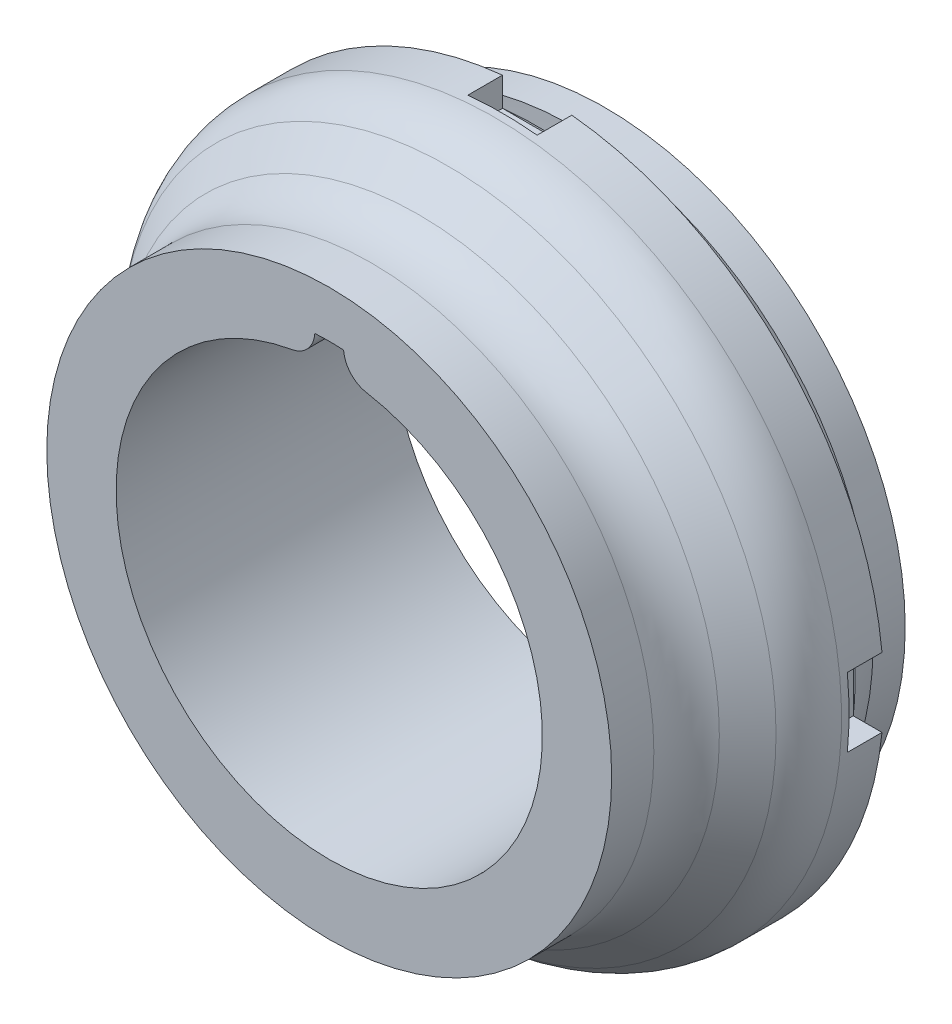
ISO-10303-21;
HEADER;
FILE_DESCRIPTION(('STEP AP214'),'2;1');
FILE_NAME('part.step','',(''),(''),'','','');
FILE_SCHEMA(('AUTOMOTIVE_DESIGN { 1 0 10303 214 1 1 1 1 }'));
ENDSEC;
DATA;
#1=APPLICATION_CONTEXT('core data for automotive mechanical design processes');
#2=APPLICATION_PROTOCOL_DEFINITION('international standard','automotive_design',2000,#1);
#3=PRODUCT_CONTEXT('',#1,'mechanical');
#4=PRODUCT('Part','Part','',(#3));
#5=PRODUCT_RELATED_PRODUCT_CATEGORY('part','',(#4));
#6=PRODUCT_DEFINITION_FORMATION('','',#4);
#7=PRODUCT_DEFINITION_CONTEXT('part definition',#1,'design');
#8=PRODUCT_DEFINITION('design','',#6,#7);
#9=PRODUCT_DEFINITION_SHAPE('','',#8);
#10=(LENGTH_UNIT() NAMED_UNIT(*) SI_UNIT(.MILLI.,.METRE.));
#11=(NAMED_UNIT(*) PLANE_ANGLE_UNIT() SI_UNIT($,.RADIAN.));
#12=(NAMED_UNIT(*) SI_UNIT($,.STERADIAN.) SOLID_ANGLE_UNIT());
#13=UNCERTAINTY_MEASURE_WITH_UNIT(LENGTH_MEASURE(1.E-05),#10,'distance_accuracy_value','');
#14=(GEOMETRIC_REPRESENTATION_CONTEXT(3) GLOBAL_UNCERTAINTY_ASSIGNED_CONTEXT((#13)) GLOBAL_UNIT_ASSIGNED_CONTEXT((#10,
#11,#12)) REPRESENTATION_CONTEXT('',''));
#15=CARTESIAN_POINT('',(0.,0.,0.));
#16=DIRECTION('',(0.,0.,1.));
#17=DIRECTION('',(1.,0.,0.));
#18=AXIS2_PLACEMENT_3D('',#15,#16,#17);
#19=CARTESIAN_POINT('',(0.,-5.,1.02));
#20=DIRECTION('',(0.,0.,-1.));
#21=DIRECTION('',(-1.,0.,0.));
#22=AXIS2_PLACEMENT_3D('',#19,#20,#21);
#23=PLANE('',#22);
#24=DIRECTION('',(-1.,0.,0.));
#25=VECTOR('',#24,1.);
#26=CARTESIAN_POINT('',(-5.43968920659189,-0.499999999999981,1.02));
#27=LINE('',#26,#25);
#28=CARTESIAN_POINT('',(-4.56031079340811,-0.499999999999984,1.02));
#29=VERTEX_POINT('',#28);
#30=CARTESIAN_POINT('',(-4.9749371855331,-0.499999999999983,1.02));
#31=VERTEX_POINT('',#30);
#32=EDGE_CURVE('E207',#29,#31,#27,.T.);
#33=ORIENTED_EDGE('',*,*,#32,.F.);
#34=CARTESIAN_POINT('',(0.,0.,1.02));
#35=DIRECTION('',(0.,0.,1.));
#36=DIRECTION('',(1.,0.,0.));
#37=AXIS2_PLACEMENT_3D('',#34,#35,#36);
#38=CIRCLE('',#37,4.587639320225);
#39=CARTESIAN_POINT('',(-0.499999999999999,-4.56031079340811,1.02));
#40=VERTEX_POINT('',#39);
#41=EDGE_CURVE('E189',#29,#40,#38,.T.);
#42=ORIENTED_EDGE('',*,*,#41,.T.);
#43=DIRECTION('',(0.,1.,0.));
#44=VECTOR('',#43,1.);
#45=CARTESIAN_POINT('',(-0.5,-5.43968920659189,1.02));
#46=LINE('',#45,#44);
#47=CARTESIAN_POINT('',(-0.5,-4.9749371855331,1.02));
#48=VERTEX_POINT('',#47);
#49=EDGE_CURVE('E311',#48,#40,#46,.T.);
#50=ORIENTED_EDGE('',*,*,#49,.F.);
#51=CARTESIAN_POINT('',(0.,0.,1.02));
#52=DIRECTION('',(0.,0.,1.));
#53=DIRECTION('',(1.,0.,0.));
#54=AXIS2_PLACEMENT_3D('',#51,#52,#53);
#55=CIRCLE('',#54,5.);
#56=EDGE_CURVE('E217',#31,#48,#55,.T.);
#57=ORIENTED_EDGE('',*,*,#56,.F.);
#58=EDGE_LOOP('',(#33,#42,#50,#57));
#59=FACE_BOUND('',#58,.T.);
#60=ADVANCED_FACE('F41',(#59),#23,.T.);
#61=DIRECTION('',(1.,0.,0.));
#62=VECTOR('',#61,1.);
#63=CARTESIAN_POINT('',(-5.43968920659189,0.500000000000019,1.02));
#64=LINE('',#63,#62);
#65=CARTESIAN_POINT('',(-4.9749371855331,0.500000000000017,1.02));
#66=VERTEX_POINT('',#65);
#67=CARTESIAN_POINT('',(-4.56031079340811,0.500000000000015,1.02));
#68=VERTEX_POINT('',#67);
#69=EDGE_CURVE('E259',#66,#68,#64,.T.);
#70=ORIENTED_EDGE('',*,*,#69,.F.);
#71=CARTESIAN_POINT('',(-0.5,4.9749371855331,1.02));
#72=VERTEX_POINT('',#71);
#73=EDGE_CURVE('E261',#72,#66,#55,.T.);
#74=ORIENTED_EDGE('',*,*,#73,.F.);
#75=DIRECTION('',(0.,1.,0.));
#76=VECTOR('',#75,1.);
#77=CARTESIAN_POINT('',(-0.5,5.43968920659189,1.02));
#78=LINE('',#77,#76);
#79=CARTESIAN_POINT('',(-0.5,4.56031079340811,1.02));
#80=VERTEX_POINT('',#79);
#81=EDGE_CURVE('E200',#80,#72,#78,.T.);
#82=ORIENTED_EDGE('',*,*,#81,.F.);
#83=EDGE_CURVE('E188',#80,#68,#38,.T.);
#84=ORIENTED_EDGE('',*,*,#83,.T.);
#85=EDGE_LOOP('',(#70,#74,#82,#84));
#86=FACE_BOUND('',#85,.T.);
#87=ADVANCED_FACE('F257',(#86),#23,.T.);
#88=DIRECTION('',(0.,-1.,0.));
#89=VECTOR('',#88,1.);
#90=CARTESIAN_POINT('',(0.5,5.43968920659189,1.02));
#91=LINE('',#90,#89);
#92=CARTESIAN_POINT('',(0.5,4.9749371855331,1.02));
#93=VERTEX_POINT('',#92);
#94=CARTESIAN_POINT('',(0.5,4.56031079340811,1.02));
#95=VERTEX_POINT('',#94);
#96=EDGE_CURVE('E747',#93,#95,#91,.T.);
#97=ORIENTED_EDGE('',*,*,#96,.F.);
#98=CARTESIAN_POINT('',(4.9749371855331,0.499999999999948,1.02));
#99=VERTEX_POINT('',#98);
#100=EDGE_CURVE('E352',#99,#93,#55,.T.);
#101=ORIENTED_EDGE('',*,*,#100,.F.);
#102=DIRECTION('',(1.,0.,0.));
#103=VECTOR('',#102,1.);
#104=CARTESIAN_POINT('',(5.43968920659189,0.499999999999943,1.02));
#105=LINE('',#104,#103);
#106=CARTESIAN_POINT('',(4.56031079340811,0.499999999999952,1.02));
#107=VERTEX_POINT('',#106);
#108=EDGE_CURVE('E297',#107,#99,#105,.T.);
#109=ORIENTED_EDGE('',*,*,#108,.F.);
#110=EDGE_CURVE('E239',#107,#95,#38,.T.);
#111=ORIENTED_EDGE('',*,*,#110,.T.);
#112=EDGE_LOOP('',(#97,#101,#109,#111));
#113=FACE_BOUND('',#112,.T.);
#114=ADVANCED_FACE('F427',(#113),#23,.T.);
#115=DIRECTION('',(-1.,0.,0.));
#116=VECTOR('',#115,1.);
#117=CARTESIAN_POINT('',(5.43968920659188,-0.500000000000057,1.02));
#118=LINE('',#117,#116);
#119=CARTESIAN_POINT('',(4.97493718553309,-0.500000000000052,1.02));
#120=VERTEX_POINT('',#119);
#121=CARTESIAN_POINT('',(4.5603107934081,-0.500000000000048,1.02));
#122=VERTEX_POINT('',#121);
#123=EDGE_CURVE('E276',#120,#122,#118,.T.);
#124=ORIENTED_EDGE('',*,*,#123,.F.);
#125=CARTESIAN_POINT('',(0.5,-4.9749371855331,1.02));
#126=VERTEX_POINT('',#125);
#127=EDGE_CURVE('E347',#126,#120,#55,.T.);
#128=ORIENTED_EDGE('',*,*,#127,.F.);
#129=DIRECTION('',(0.,-1.,0.));
#130=VECTOR('',#129,1.);
#131=CARTESIAN_POINT('',(0.5,-5.43968920659189,1.02));
#132=LINE('',#131,#130);
#133=CARTESIAN_POINT('',(0.5,-4.56031079340811,1.02));
#134=VERTEX_POINT('',#133);
#135=EDGE_CURVE('E218',#134,#126,#132,.T.);
#136=ORIENTED_EDGE('',*,*,#135,.F.);
#137=EDGE_CURVE('E229',#134,#122,#38,.T.);
#138=ORIENTED_EDGE('',*,*,#137,.T.);
#139=EDGE_LOOP('',(#124,#128,#136,#138));
#140=FACE_BOUND('',#139,.T.);
#141=ADVANCED_FACE('F422',(#140),#23,.T.);
#142=CARTESIAN_POINT('',(0.,0.,0.));
#143=DIRECTION('',(0.,0.,1.));
#144=DIRECTION('',(1.,0.,0.));
#145=AXIS2_PLACEMENT_3D('',#142,#143,#144);
#146=CYLINDRICAL_SURFACE('',#145,5.);
#147=CARTESIAN_POINT('',(0.,0.,1.62841808369457));
#148=DIRECTION('',(0.,0.,-1.));
#149=DIRECTION('',(-1.,0.,0.));
#150=AXIS2_PLACEMENT_3D('',#147,#148,#149);
#151=CIRCLE('',#150,5.);
#152=CARTESIAN_POINT('',(-5.,0.,1.62841808369457));
#153=VERTEX_POINT('',#152);
#154=EDGE_CURVE('E49',#153,#153,#151,.T.);
#155=ORIENTED_EDGE('',*,*,#154,.T.);
#156=EDGE_LOOP('',(#155));
#157=FACE_BOUND('',#156,.T.);
#158=DIRECTION('',(0.,0.,1.));
#159=VECTOR('',#158,1.);
#160=CARTESIAN_POINT('',(-4.9749371855331,-0.499999999999983,0.));
#161=LINE('',#160,#159);
#162=CARTESIAN_POINT('',(-4.9749371855331,-0.499999999999983,1.52));
#163=VERTEX_POINT('',#162);
#164=EDGE_CURVE('E210',#31,#163,#161,.T.);
#165=ORIENTED_EDGE('',*,*,#164,.F.);
#166=ORIENTED_EDGE('',*,*,#56,.T.);
#167=DIRECTION('',(0.,0.,1.));
#168=VECTOR('',#167,1.);
#169=CARTESIAN_POINT('',(-0.5,-4.9749371855331,0.));
#170=LINE('',#169,#168);
#171=CARTESIAN_POINT('',(-0.5,-4.9749371855331,1.52));
#172=VERTEX_POINT('',#171);
#173=EDGE_CURVE('E318',#172,#48,#170,.F.);
#174=ORIENTED_EDGE('',*,*,#173,.F.);
#175=CARTESIAN_POINT('',(0.,0.,1.52));
#176=DIRECTION('',(0.,0.,-1.));
#177=DIRECTION('',(-1.,0.,0.));
#178=AXIS2_PLACEMENT_3D('',#175,#176,#177);
#179=CIRCLE('',#178,5.);
#180=CARTESIAN_POINT('',(0.5,-4.9749371855331,1.52));
#181=VERTEX_POINT('',#180);
#182=EDGE_CURVE('E346',#172,#181,#179,.F.);
#183=ORIENTED_EDGE('',*,*,#182,.T.);
#184=DIRECTION('',(0.,0.,1.));
#185=VECTOR('',#184,1.);
#186=CARTESIAN_POINT('',(0.5,-4.9749371855331,0.));
#187=LINE('',#186,#185);
#188=EDGE_CURVE('E323',#126,#181,#187,.T.);
#189=ORIENTED_EDGE('',*,*,#188,.F.);
#190=ORIENTED_EDGE('',*,*,#127,.T.);
#191=DIRECTION('',(0.,0.,1.));
#192=VECTOR('',#191,1.);
#193=CARTESIAN_POINT('',(4.97493718553309,-0.500000000000052,0.));
#194=LINE('',#193,#192);
#195=CARTESIAN_POINT('',(4.97493718553309,-0.500000000000052,1.52));
#196=VERTEX_POINT('',#195);
#197=EDGE_CURVE('E274',#196,#120,#194,.F.);
#198=ORIENTED_EDGE('',*,*,#197,.F.);
#199=CARTESIAN_POINT('',(0.,0.,1.52));
#200=DIRECTION('',(0.,0.,-1.));
#201=DIRECTION('',(0.,-1.,0.));
#202=AXIS2_PLACEMENT_3D('',#199,#200,#201);
#203=CIRCLE('',#202,5.);
#204=CARTESIAN_POINT('',(4.9749371855331,0.499999999999948,1.52));
#205=VERTEX_POINT('',#204);
#206=EDGE_CURVE('E288',#196,#205,#203,.F.);
#207=ORIENTED_EDGE('',*,*,#206,.T.);
#208=DIRECTION('',(0.,0.,1.));
#209=VECTOR('',#208,1.);
#210=CARTESIAN_POINT('',(4.9749371855331,0.499999999999948,0.));
#211=LINE('',#210,#209);
#212=EDGE_CURVE('E294',#99,#205,#211,.T.);
#213=ORIENTED_EDGE('',*,*,#212,.F.);
#214=ORIENTED_EDGE('',*,*,#100,.T.);
#215=DIRECTION('',(0.,0.,1.));
#216=VECTOR('',#215,1.);
#217=CARTESIAN_POINT('',(0.5,4.9749371855331,0.));
#218=LINE('',#217,#216);
#219=CARTESIAN_POINT('',(0.5,4.9749371855331,1.52));
#220=VERTEX_POINT('',#219);
#221=EDGE_CURVE('E769',#220,#93,#218,.F.);
#222=ORIENTED_EDGE('',*,*,#221,.F.);
#223=CARTESIAN_POINT('',(0.,0.,1.52));
#224=DIRECTION('',(0.,0.,-1.));
#225=DIRECTION('',(1.,0.,0.));
#226=AXIS2_PLACEMENT_3D('',#223,#224,#225);
#227=CIRCLE('',#226,5.);
#228=CARTESIAN_POINT('',(-0.5,4.9749371855331,1.52));
#229=VERTEX_POINT('',#228);
#230=EDGE_CURVE('E753',#220,#229,#227,.F.);
#231=ORIENTED_EDGE('',*,*,#230,.T.);
#232=DIRECTION('',(0.,0.,1.));
#233=VECTOR('',#232,1.);
#234=CARTESIAN_POINT('',(-0.5,4.9749371855331,0.));
#235=LINE('',#234,#233);
#236=EDGE_CURVE('E266',#72,#229,#235,.T.);
#237=ORIENTED_EDGE('',*,*,#236,.F.);
#238=ORIENTED_EDGE('',*,*,#73,.T.);
#239=DIRECTION('',(0.,0.,1.));
#240=VECTOR('',#239,1.);
#241=CARTESIAN_POINT('',(-4.9749371855331,0.500000000000017,0.));
#242=LINE('',#241,#240);
#243=CARTESIAN_POINT('',(-4.9749371855331,0.500000000000017,1.52));
#244=VERTEX_POINT('',#243);
#245=EDGE_CURVE('E199',#244,#66,#242,.F.);
#246=ORIENTED_EDGE('',*,*,#245,.F.);
#247=CARTESIAN_POINT('',(0.,0.,1.52));
#248=DIRECTION('',(0.,0.,-1.));
#249=DIRECTION('',(0.,1.,0.));
#250=AXIS2_PLACEMENT_3D('',#247,#248,#249);
#251=CIRCLE('',#250,5.);
#252=EDGE_CURVE('E211',#244,#163,#251,.F.);
#253=ORIENTED_EDGE('',*,*,#252,.T.);
#254=EDGE_LOOP('',(#165,#166,#174,#183,#189,#190,#198,#207,#213,#214,#222,#231,#237,#238,#246,#253));
#255=FACE_BOUND('',#254,.T.);
#256=ADVANCED_FACE('F372',(#157,#255),#146,.T.);
#257=CARTESIAN_POINT('',(0.,0.,3.02));
#258=DIRECTION('',(0.,0.,-1.));
#259=DIRECTION('',(-1.,0.,0.));
#260=AXIS2_PLACEMENT_3D('',#257,#258,#259);
#261=CONICAL_SURFACE('',#260,4.075,0.746456820300408);
#262=CARTESIAN_POINT('',(0.,0.,2.30746006531199));
#263=DIRECTION('',(0.,0.,1.));
#264=DIRECTION('',(1.,0.,0.));
#265=AXIS2_PLACEMENT_3D('',#262,#263,#264);
#266=CIRCLE('',#265,4.73409943958641);
#267=CARTESIAN_POINT('',(4.73409943958641,0.,2.30746006531199));
#268=VERTEX_POINT('',#267);
#269=EDGE_CURVE('E367',#268,#268,#266,.T.);
#270=ORIENTED_EDGE('',*,*,#269,.T.);
#271=EDGE_LOOP('',(#270));
#272=FACE_BOUND('',#271,.T.);
#273=CARTESIAN_POINT('',(0.,0.,2.73253993468801));
#274=DIRECTION('',(0.,0.,-1.));
#275=DIRECTION('',(-1.,0.,0.));
#276=AXIS2_PLACEMENT_3D('',#273,#274,#275);
#277=CIRCLE('',#276,4.34090056041359);
#278=CARTESIAN_POINT('',(-4.34090056041359,0.,2.73253993468801));
#279=VERTEX_POINT('',#278);
#280=EDGE_CURVE('E364',#279,#279,#277,.T.);
#281=ORIENTED_EDGE('',*,*,#280,.T.);
#282=EDGE_LOOP('',(#281));
#283=FACE_BOUND('',#282,.T.);
#284=ADVANCED_FACE('F381',(#272,#283),#261,.T.);
#285=CARTESIAN_POINT('',(0.,0.,0.));
#286=DIRECTION('',(0.,0.,1.));
#287=DIRECTION('',(1.,0.,0.));
#288=AXIS2_PLACEMENT_3D('',#285,#286,#287);
#289=CYLINDRICAL_SURFACE('',#288,4.075);
#290=CARTESIAN_POINT('',(0.,0.,3.41158191630544));
#291=DIRECTION('',(0.,0.,1.));
#292=DIRECTION('',(1.,0.,0.));
#293=AXIS2_PLACEMENT_3D('',#290,#291,#292);
#294=CIRCLE('',#293,4.075);
#295=CARTESIAN_POINT('',(4.075,0.,3.41158191630544));
#296=VERTEX_POINT('',#295);
#297=EDGE_CURVE('E11',#296,#296,#294,.T.);
#298=ORIENTED_EDGE('',*,*,#297,.T.);
#299=EDGE_LOOP('',(#298));
#300=FACE_BOUND('',#299,.T.);
#301=CARTESIAN_POINT('',(0.,0.,4.02));
#302=DIRECTION('',(0.,0.,1.));
#303=DIRECTION('',(1.,0.,0.));
#304=AXIS2_PLACEMENT_3D('',#301,#302,#303);
#305=CIRCLE('',#304,4.075);
#306=CARTESIAN_POINT('',(4.075,0.,4.02));
#307=VERTEX_POINT('',#306);
#308=EDGE_CURVE('E398',#307,#307,#305,.T.);
#309=ORIENTED_EDGE('',*,*,#308,.F.);
#310=EDGE_LOOP('',(#309));
#311=FACE_BOUND('',#310,.T.);
#312=ADVANCED_FACE('F384',(#300,#311),#289,.T.);
#313=CARTESIAN_POINT('',(0.,-4.075,4.02));
#314=DIRECTION('',(0.,0.,1.));
#315=DIRECTION('',(1.,0.,0.));
#316=AXIS2_PLACEMENT_3D('',#313,#314,#315);
#317=PLANE('',#316);
#318=CARTESIAN_POINT('',(0.,0.,4.02));
#319=DIRECTION('',(0.,0.,1.));
#320=DIRECTION('',(1.,0.,0.));
#321=AXIS2_PLACEMENT_3D('',#318,#319,#320);
#322=CIRCLE('',#321,3.075);
#323=CARTESIAN_POINT('',(-0.53676182485942,3.02778991070609,4.02));
#324=VERTEX_POINT('',#323);
#325=CARTESIAN_POINT('',(0.536761824859422,3.02778991070609,4.02));
#326=VERTEX_POINT('',#325);
#327=EDGE_CURVE('E400',#324,#326,#322,.T.);
#328=ORIENTED_EDGE('',*,*,#327,.F.);
#329=CARTESIAN_POINT('',(-0.606584501263897,3.42164876087924,4.02));
#330=DIRECTION('',(0.,0.,1.));
#331=DIRECTION('',(1.,0.,0.));
#332=AXIS2_PLACEMENT_3D('',#329,#330,#331);
#333=CIRCLE('',#332,0.4);
#334=CARTESIAN_POINT('',(-0.207565034420009,3.39365831465879,4.02));
#335=VERTEX_POINT('',#334);
#336=EDGE_CURVE('E332',#324,#335,#333,.T.);
#337=ORIENTED_EDGE('',*,*,#336,.T.);
#338=CARTESIAN_POINT('',(0.,0.,4.02));
#339=DIRECTION('',(0.,0.,-1.));
#340=DIRECTION('',(-1.,0.,0.));
#341=AXIS2_PLACEMENT_3D('',#338,#339,#340);
#342=CIRCLE('',#341,3.40000000002449);
#343=CARTESIAN_POINT('',(0.207565034420009,3.39365831465879,4.02));
#344=VERTEX_POINT('',#343);
#345=EDGE_CURVE('E224',#335,#344,#342,.T.);
#346=ORIENTED_EDGE('',*,*,#345,.T.);
#347=CARTESIAN_POINT('',(0.6065845012639,3.42164876087924,4.02));
#348=DIRECTION('',(0.,0.,1.));
#349=DIRECTION('',(1.,0.,0.));
#350=AXIS2_PLACEMENT_3D('',#347,#348,#349);
#351=CIRCLE('',#350,0.4);
#352=EDGE_CURVE('E56',#344,#326,#351,.T.);
#353=ORIENTED_EDGE('',*,*,#352,.T.);
#354=EDGE_LOOP('',(#328,#337,#346,#353));
#355=FACE_BOUND('',#354,.T.);
#356=ORIENTED_EDGE('',*,*,#308,.T.);
#357=EDGE_LOOP('',(#356));
#358=FACE_BOUND('',#357,.T.);
#359=ADVANCED_FACE('F394',(#355,#358),#317,.T.);
#360=CARTESIAN_POINT('',(0.,0.,0.));
#361=DIRECTION('',(0.,0.,1.));
#362=DIRECTION('',(1.,0.,0.));
#363=AXIS2_PLACEMENT_3D('',#360,#361,#362);
#364=CYLINDRICAL_SURFACE('',#363,3.075);
#365=CARTESIAN_POINT('',(0.,0.,0.0399999999999998));
#366=DIRECTION('',(0.,0.,1.));
#367=DIRECTION('',(1.,0.,0.));
#368=AXIS2_PLACEMENT_3D('',#365,#366,#367);
#369=CIRCLE('',#368,3.075);
#370=CARTESIAN_POINT('',(-0.53676182485942,3.02778991070609,0.0399999999999998));
#371=VERTEX_POINT('',#370);
#372=CARTESIAN_POINT('',(0.536761824859422,3.02778991070609,0.0399999999999998));
#373=VERTEX_POINT('',#372);
#374=EDGE_CURVE('E401',#371,#373,#369,.T.);
#375=ORIENTED_EDGE('',*,*,#374,.F.);
#376=DIRECTION('',(0.,0.,1.));
#377=VECTOR('',#376,1.);
#378=CARTESIAN_POINT('',(-0.53676182485942,3.02778991070609,0.));
#379=LINE('',#378,#377);
#380=EDGE_CURVE('E63',#371,#324,#379,.T.);
#381=ORIENTED_EDGE('',*,*,#380,.T.);
#382=ORIENTED_EDGE('',*,*,#327,.T.);
#383=DIRECTION('',(0.,0.,1.));
#384=VECTOR('',#383,1.);
#385=CARTESIAN_POINT('',(0.536761824859422,3.02778991070609,0.));
#386=LINE('',#385,#384);
#387=EDGE_CURVE('E358',#326,#373,#386,.F.);
#388=ORIENTED_EDGE('',*,*,#387,.T.);
#389=EDGE_LOOP('',(#375,#381,#382,#388));
#390=FACE_BOUND('',#389,.T.);
#391=ADVANCED_FACE('F411',(#390),#364,.F.);
#392=CARTESIAN_POINT('',(0.,-4.33,0.0399999999999998));
#393=DIRECTION('',(0.,0.,-1.));
#394=DIRECTION('',(-1.,0.,0.));
#395=AXIS2_PLACEMENT_3D('',#392,#393,#394);
#396=PLANE('',#395);
#397=CARTESIAN_POINT('',(0.,0.,0.0399999999999998));
#398=DIRECTION('',(0.,0.,-1.));
#399=DIRECTION('',(-1.,0.,0.));
#400=AXIS2_PLACEMENT_3D('',#397,#398,#399);
#401=CIRCLE('',#400,3.40000000002449);
#402=CARTESIAN_POINT('',(-0.207565034420009,3.39365831465879,0.0400000000000001));
#403=VERTEX_POINT('',#402);
#404=CARTESIAN_POINT('',(0.207565034420009,3.3936583146588,0.0399999999999998));
#405=VERTEX_POINT('',#404);
#406=EDGE_CURVE('E339',#403,#405,#401,.T.);
#407=ORIENTED_EDGE('',*,*,#406,.F.);
#408=CARTESIAN_POINT('',(-0.606584501263897,3.42164876087924,0.0399999999999998));
#409=DIRECTION('',(0.,0.,-1.));
#410=DIRECTION('',(-1.,0.,0.));
#411=AXIS2_PLACEMENT_3D('',#408,#409,#410);
#412=CIRCLE('',#411,0.4);
#413=EDGE_CURVE('E333',#403,#371,#412,.T.);
#414=ORIENTED_EDGE('',*,*,#413,.T.);
#415=ORIENTED_EDGE('',*,*,#374,.T.);
#416=CARTESIAN_POINT('',(0.6065845012639,3.42164876087924,0.0399999999999998));
#417=DIRECTION('',(0.,0.,-1.));
#418=DIRECTION('',(-1.,0.,0.));
#419=AXIS2_PLACEMENT_3D('',#416,#417,#418);
#420=CIRCLE('',#419,0.4);
#421=EDGE_CURVE('E345',#373,#405,#420,.T.);
#422=ORIENTED_EDGE('',*,*,#421,.T.);
#423=EDGE_LOOP('',(#407,#414,#415,#422));
#424=FACE_BOUND('',#423,.T.);
#425=CARTESIAN_POINT('',(0.,0.,0.0399999999999998));
#426=DIRECTION('',(0.,0.,1.));
#427=DIRECTION('',(1.,0.,0.));
#428=AXIS2_PLACEMENT_3D('',#425,#426,#427);
#429=CIRCLE('',#428,4.33);
#430=CARTESIAN_POINT('',(4.33,0.,0.0399999999999998));
#431=VERTEX_POINT('',#430);
#432=EDGE_CURVE('E233',#431,#431,#429,.T.);
#433=ORIENTED_EDGE('',*,*,#432,.F.);
#434=EDGE_LOOP('',(#433));
#435=FACE_BOUND('',#434,.T.);
#436=ADVANCED_FACE('F342',(#424,#435),#396,.T.);
#437=CARTESIAN_POINT('',(0.,0.,0.));
#438=DIRECTION('',(0.,0.,1.));
#439=DIRECTION('',(1.,0.,0.));
#440=AXIS2_PLACEMENT_3D('',#437,#438,#439);
#441=CYLINDRICAL_SURFACE('',#440,4.33);
#442=ORIENTED_EDGE('',*,*,#432,.T.);
#443=EDGE_LOOP('',(#442));
#444=FACE_BOUND('',#443,.T.);
#445=CARTESIAN_POINT('',(0.,0.,0.504721359549997));
#446=DIRECTION('',(0.,0.,1.));
#447=DIRECTION('',(1.,0.,0.));
#448=AXIS2_PLACEMENT_3D('',#445,#446,#447);
#449=CIRCLE('',#448,4.33);
#450=CARTESIAN_POINT('',(4.33,0.,0.504721359549997));
#451=VERTEX_POINT('',#450);
#452=EDGE_CURVE('E228',#451,#451,#449,.T.);
#453=ORIENTED_EDGE('',*,*,#452,.F.);
#454=EDGE_LOOP('',(#453));
#455=FACE_BOUND('',#454,.T.);
#456=ADVANCED_FACE('F408',(#444,#455),#441,.T.);
#457=CARTESIAN_POINT('',(0.,0.,1.02));
#458=DIRECTION('',(0.,0.,1.));
#459=DIRECTION('',(1.,0.,0.));
#460=AXIS2_PLACEMENT_3D('',#457,#458,#459);
#461=CONICAL_SURFACE('',#460,4.587639320225,0.463647609000806);
#462=ORIENTED_EDGE('',*,*,#452,.T.);
#463=EDGE_LOOP('',(#462));
#464=FACE_BOUND('',#463,.T.);
#465=EDGE_CURVE('E223',#40,#134,#38,.T.);
#466=ORIENTED_EDGE('',*,*,#465,.F.);
#467=ORIENTED_EDGE('',*,*,#41,.F.);
#468=EDGE_CURVE('E180',#68,#29,#38,.T.);
#469=ORIENTED_EDGE('',*,*,#468,.F.);
#470=ORIENTED_EDGE('',*,*,#83,.F.);
#471=EDGE_CURVE('E245',#95,#80,#38,.T.);
#472=ORIENTED_EDGE('',*,*,#471,.F.);
#473=ORIENTED_EDGE('',*,*,#110,.F.);
#474=EDGE_CURVE('E235',#122,#107,#38,.T.);
#475=ORIENTED_EDGE('',*,*,#474,.F.);
#476=ORIENTED_EDGE('',*,*,#137,.F.);
#477=EDGE_LOOP('',(#466,#467,#469,#470,#472,#473,#475,#476));
#478=FACE_BOUND('',#477,.T.);
#479=ADVANCED_FACE('F221',(#464,#478),#461,.T.);
#480=CARTESIAN_POINT('',(0.,0.,0.));
#481=DIRECTION('',(0.,0.,-1.));
#482=DIRECTION('',(-1.,0.,0.));
#483=AXIS2_PLACEMENT_3D('',#480,#481,#482);
#484=CYLINDRICAL_SURFACE('',#483,3.40000000002449);
#485=ORIENTED_EDGE('',*,*,#406,.T.);
#486=DIRECTION('',(0.,0.,1.));
#487=VECTOR('',#486,1.);
#488=CARTESIAN_POINT('',(0.207565034420009,3.39365831465879,4.02));
#489=LINE('',#488,#487);
#490=EDGE_CURVE('E325',#405,#344,#489,.T.);
#491=ORIENTED_EDGE('',*,*,#490,.T.);
#492=ORIENTED_EDGE('',*,*,#345,.F.);
#493=DIRECTION('',(0.,0.,1.));
#494=VECTOR('',#493,1.);
#495=CARTESIAN_POINT('',(-0.207565034420009,3.39365831465879,4.02));
#496=LINE('',#495,#494);
#497=EDGE_CURVE('E225',#403,#335,#496,.T.);
#498=ORIENTED_EDGE('',*,*,#497,.F.);
#499=EDGE_LOOP('',(#485,#491,#492,#498));
#500=FACE_BOUND('',#499,.T.);
#501=ADVANCED_FACE('F338',(#500),#484,.F.);
#502=CARTESIAN_POINT('',(0.5,-5.43968920659189,1.52));
#503=DIRECTION('',(1.,0.,0.));
#504=DIRECTION('',(0.,0.,-1.));
#505=AXIS2_PLACEMENT_3D('',#502,#503,#504);
#506=PLANE('',#505);
#507=ORIENTED_EDGE('',*,*,#188,.T.);
#508=DIRECTION('',(0.,-1.,0.));
#509=VECTOR('',#508,1.);
#510=CARTESIAN_POINT('',(0.5,-5.43968920659189,1.52));
#511=LINE('',#510,#509);
#512=CARTESIAN_POINT('',(0.5,-4.56031079340811,1.52));
#513=VERTEX_POINT('',#512);
#514=EDGE_CURVE('E300',#513,#181,#511,.T.);
#515=ORIENTED_EDGE('',*,*,#514,.F.);
#516=DIRECTION('',(0.,0.,-1.));
#517=VECTOR('',#516,1.);
#518=CARTESIAN_POINT('',(0.5,-4.56031079340811,1.52));
#519=LINE('',#518,#517);
#520=EDGE_CURVE('E316',#513,#134,#519,.T.);
#521=ORIENTED_EDGE('',*,*,#520,.T.);
#522=ORIENTED_EDGE('',*,*,#135,.T.);
#523=EDGE_LOOP('',(#507,#515,#521,#522));
#524=FACE_BOUND('',#523,.T.);
#525=ADVANCED_FACE('F443',(#524),#506,.F.);
#526=CARTESIAN_POINT('',(-0.5,-4.56031079340811,1.52));
#527=DIRECTION('',(0.,1.,0.));
#528=DIRECTION('',(0.,0.,1.));
#529=AXIS2_PLACEMENT_3D('',#526,#527,#528);
#530=PLANE('',#529);
#531=DIRECTION('',(1.,0.,0.));
#532=VECTOR('',#531,1.);
#533=CARTESIAN_POINT('',(-0.5,-4.56031079340811,1.02));
#534=LINE('',#533,#532);
#535=EDGE_CURVE('E304',#40,#134,#534,.T.);
#536=ORIENTED_EDGE('',*,*,#535,.T.);
#537=ORIENTED_EDGE('',*,*,#520,.F.);
#538=DIRECTION('',(1.,0.,0.));
#539=VECTOR('',#538,1.);
#540=CARTESIAN_POINT('',(-0.5,-4.56031079340811,1.52));
#541=LINE('',#540,#539);
#542=CARTESIAN_POINT('',(-0.5,-4.56031079340811,1.52));
#543=VERTEX_POINT('',#542);
#544=EDGE_CURVE('E306',#543,#513,#541,.T.);
#545=ORIENTED_EDGE('',*,*,#544,.F.);
#546=DIRECTION('',(0.,0.,-1.));
#547=VECTOR('',#546,1.);
#548=CARTESIAN_POINT('',(-0.5,-4.56031079340811,1.52));
#549=LINE('',#548,#547);
#550=EDGE_CURVE('E309',#543,#40,#549,.T.);
#551=ORIENTED_EDGE('',*,*,#550,.T.);
#552=EDGE_LOOP('',(#536,#537,#545,#551));
#553=FACE_BOUND('',#552,.T.);
#554=ADVANCED_FACE('F450',(#553),#530,.F.);
#555=CARTESIAN_POINT('',(-0.5,-5.43968920659189,1.52));
#556=DIRECTION('',(-1.,0.,0.));
#557=DIRECTION('',(0.,0.,1.));
#558=AXIS2_PLACEMENT_3D('',#555,#556,#557);
#559=PLANE('',#558);
#560=ORIENTED_EDGE('',*,*,#173,.T.);
#561=ORIENTED_EDGE('',*,*,#49,.T.);
#562=ORIENTED_EDGE('',*,*,#550,.F.);
#563=DIRECTION('',(0.,1.,0.));
#564=VECTOR('',#563,1.);
#565=CARTESIAN_POINT('',(-0.5,-5.43968920659189,1.52));
#566=LINE('',#565,#564);
#567=EDGE_CURVE('E303',#172,#543,#566,.T.);
#568=ORIENTED_EDGE('',*,*,#567,.F.);
#569=EDGE_LOOP('',(#560,#561,#562,#568));
#570=FACE_BOUND('',#569,.T.);
#571=ADVANCED_FACE('F463',(#570),#559,.F.);
#572=CARTESIAN_POINT('',(0.,0.,1.52));
#573=DIRECTION('',(0.,0.,-1.));
#574=DIRECTION('',(-1.,0.,0.));
#575=AXIS2_PLACEMENT_3D('',#572,#573,#574);
#576=PLANE('',#575);
#577=ORIENTED_EDGE('',*,*,#567,.T.);
#578=ORIENTED_EDGE('',*,*,#544,.T.);
#579=ORIENTED_EDGE('',*,*,#514,.T.);
#580=ORIENTED_EDGE('',*,*,#182,.F.);
#581=EDGE_LOOP('',(#577,#578,#579,#580));
#582=FACE_BOUND('',#581,.T.);
#583=ADVANCED_FACE('F445',(#582),#576,.T.);
#584=CARTESIAN_POINT('',(0.,0.,1.02));
#585=DIRECTION('',(0.,0.,-1.));
#586=DIRECTION('',(-1.,0.,0.));
#587=AXIS2_PLACEMENT_3D('',#584,#585,#586);
#588=PLANE('',#587);
#589=ORIENTED_EDGE('',*,*,#465,.T.);
#590=ORIENTED_EDGE('',*,*,#535,.F.);
#591=EDGE_LOOP('',(#589,#590));
#592=FACE_BOUND('',#591,.T.);
#593=ADVANCED_FACE('F451',(#592),#588,.F.);
#594=CARTESIAN_POINT('',(5.43968920659189,0.499999999999943,1.52));
#595=DIRECTION('',(0.,1.,0.));
#596=DIRECTION('',(0.,0.,-1.));
#597=AXIS2_PLACEMENT_3D('',#594,#595,#596);
#598=PLANE('',#597);
#599=ORIENTED_EDGE('',*,*,#212,.T.);
#600=DIRECTION('',(1.,0.,0.));
#601=VECTOR('',#600,1.);
#602=CARTESIAN_POINT('',(5.43968920659189,0.499999999999943,1.52));
#603=LINE('',#602,#601);
#604=CARTESIAN_POINT('',(4.56031079340811,0.499999999999952,1.52));
#605=VERTEX_POINT('',#604);
#606=EDGE_CURVE('E286',#605,#205,#603,.T.);
#607=ORIENTED_EDGE('',*,*,#606,.F.);
#608=DIRECTION('',(0.,0.,-1.));
#609=VECTOR('',#608,1.);
#610=CARTESIAN_POINT('',(4.56031079340811,0.499999999999952,1.52));
#611=LINE('',#610,#609);
#612=EDGE_CURVE('E291',#605,#107,#611,.T.);
#613=ORIENTED_EDGE('',*,*,#612,.T.);
#614=ORIENTED_EDGE('',*,*,#108,.T.);
#615=EDGE_LOOP('',(#599,#607,#613,#614));
#616=FACE_BOUND('',#615,.T.);
#617=ADVANCED_FACE('F453',(#616),#598,.F.);
#618=CARTESIAN_POINT('',(4.5603107934081,-0.500000000000048,1.52));
#619=DIRECTION('',(-1.,0.,0.));
#620=DIRECTION('',(0.,0.,1.));
#621=AXIS2_PLACEMENT_3D('',#618,#619,#620);
#622=PLANE('',#621);
#623=DIRECTION('',(0.,1.,0.));
#624=VECTOR('',#623,1.);
#625=CARTESIAN_POINT('',(4.5603107934081,-0.500000000000048,1.02));
#626=LINE('',#625,#624);
#627=EDGE_CURVE('E272',#122,#107,#626,.T.);
#628=ORIENTED_EDGE('',*,*,#627,.T.);
#629=ORIENTED_EDGE('',*,*,#612,.F.);
#630=DIRECTION('',(0.,1.,0.));
#631=VECTOR('',#630,1.);
#632=CARTESIAN_POINT('',(4.5603107934081,-0.500000000000048,1.52));
#633=LINE('',#632,#631);
#634=CARTESIAN_POINT('',(4.5603107934081,-0.500000000000048,1.52));
#635=VERTEX_POINT('',#634);
#636=EDGE_CURVE('E284',#635,#605,#633,.T.);
#637=ORIENTED_EDGE('',*,*,#636,.F.);
#638=DIRECTION('',(0.,0.,-1.));
#639=VECTOR('',#638,1.);
#640=CARTESIAN_POINT('',(4.5603107934081,-0.500000000000048,1.52));
#641=LINE('',#640,#639);
#642=EDGE_CURVE('E279',#635,#122,#641,.T.);
#643=ORIENTED_EDGE('',*,*,#642,.T.);
#644=EDGE_LOOP('',(#628,#629,#637,#643));
#645=FACE_BOUND('',#644,.T.);
#646=ADVANCED_FACE('F460',(#645),#622,.F.);
#647=CARTESIAN_POINT('',(0.,0.,1.52));
#648=DIRECTION('',(0.,0.,-1.));
#649=DIRECTION('',(0.,-1.,0.));
#650=AXIS2_PLACEMENT_3D('',#647,#648,#649);
#651=PLANE('',#650);
#652=DIRECTION('',(-1.,0.,0.));
#653=VECTOR('',#652,1.);
#654=CARTESIAN_POINT('',(5.43968920659188,-0.500000000000057,1.52));
#655=LINE('',#654,#653);
#656=EDGE_CURVE('E281',#196,#635,#655,.T.);
#657=ORIENTED_EDGE('',*,*,#656,.T.);
#658=ORIENTED_EDGE('',*,*,#636,.T.);
#659=ORIENTED_EDGE('',*,*,#606,.T.);
#660=ORIENTED_EDGE('',*,*,#206,.F.);
#661=EDGE_LOOP('',(#657,#658,#659,#660));
#662=FACE_BOUND('',#661,.T.);
#663=ADVANCED_FACE('F695',(#662),#651,.T.);
#664=CARTESIAN_POINT('',(5.43968920659188,-0.500000000000057,1.52));
#665=DIRECTION('',(0.,-1.,0.));
#666=DIRECTION('',(0.,0.,1.));
#667=AXIS2_PLACEMENT_3D('',#664,#665,#666);
#668=PLANE('',#667);
#669=ORIENTED_EDGE('',*,*,#197,.T.);
#670=ORIENTED_EDGE('',*,*,#123,.T.);
#671=ORIENTED_EDGE('',*,*,#642,.F.);
#672=ORIENTED_EDGE('',*,*,#656,.F.);
#673=EDGE_LOOP('',(#669,#670,#671,#672));
#674=FACE_BOUND('',#673,.T.);
#675=ADVANCED_FACE('F687',(#674),#668,.F.);
#676=CARTESIAN_POINT('',(0.,0.,1.02));
#677=DIRECTION('',(0.,0.,-1.));
#678=DIRECTION('',(0.,-1.,0.));
#679=AXIS2_PLACEMENT_3D('',#676,#677,#678);
#680=PLANE('',#679);
#681=ORIENTED_EDGE('',*,*,#474,.T.);
#682=ORIENTED_EDGE('',*,*,#627,.F.);
#683=EDGE_LOOP('',(#681,#682));
#684=FACE_BOUND('',#683,.T.);
#685=ADVANCED_FACE('F679',(#684),#680,.F.);
#686=CARTESIAN_POINT('',(-0.5,5.43968920659189,1.52));
#687=DIRECTION('',(-1.,0.,0.));
#688=DIRECTION('',(0.,0.,-1.));
#689=AXIS2_PLACEMENT_3D('',#686,#687,#688);
#690=PLANE('',#689);
#691=ORIENTED_EDGE('',*,*,#236,.T.);
#692=DIRECTION('',(0.,1.,0.));
#693=VECTOR('',#692,1.);
#694=CARTESIAN_POINT('',(-0.5,5.43968920659189,1.52));
#695=LINE('',#694,#693);
#696=CARTESIAN_POINT('',(-0.5,4.56031079340811,1.52));
#697=VERTEX_POINT('',#696);
#698=EDGE_CURVE('E755',#697,#229,#695,.T.);
#699=ORIENTED_EDGE('',*,*,#698,.F.);
#700=DIRECTION('',(0.,0.,-1.));
#701=VECTOR('',#700,1.);
#702=CARTESIAN_POINT('',(-0.5,4.56031079340811,1.52));
#703=LINE('',#702,#701);
#704=EDGE_CURVE('E268',#697,#80,#703,.T.);
#705=ORIENTED_EDGE('',*,*,#704,.T.);
#706=ORIENTED_EDGE('',*,*,#81,.T.);
#707=EDGE_LOOP('',(#691,#699,#705,#706));
#708=FACE_BOUND('',#707,.T.);
#709=ADVANCED_FACE('F670',(#708),#690,.F.);
#710=CARTESIAN_POINT('',(0.5,4.56031079340811,1.52));
#711=DIRECTION('',(0.,-1.,0.));
#712=DIRECTION('',(0.,0.,1.));
#713=AXIS2_PLACEMENT_3D('',#710,#711,#712);
#714=PLANE('',#713);
#715=DIRECTION('',(-1.,0.,0.));
#716=VECTOR('',#715,1.);
#717=CARTESIAN_POINT('',(0.5,4.56031079340811,1.02));
#718=LINE('',#717,#716);
#719=EDGE_CURVE('E299',#95,#80,#718,.T.);
#720=ORIENTED_EDGE('',*,*,#719,.T.);
#721=ORIENTED_EDGE('',*,*,#704,.F.);
#722=DIRECTION('',(-1.,0.,0.));
#723=VECTOR('',#722,1.);
#724=CARTESIAN_POINT('',(0.5,4.56031079340811,1.52));
#725=LINE('',#724,#723);
#726=CARTESIAN_POINT('',(0.5,4.56031079340811,1.52));
#727=VERTEX_POINT('',#726);
#728=EDGE_CURVE('E757',#727,#697,#725,.T.);
#729=ORIENTED_EDGE('',*,*,#728,.F.);
#730=DIRECTION('',(0.,0.,-1.));
#731=VECTOR('',#730,1.);
#732=CARTESIAN_POINT('',(0.5,4.56031079340811,1.52));
#733=LINE('',#732,#731);
#734=EDGE_CURVE('E766',#727,#95,#733,.T.);
#735=ORIENTED_EDGE('',*,*,#734,.T.);
#736=EDGE_LOOP('',(#720,#721,#729,#735));
#737=FACE_BOUND('',#736,.T.);
#738=ADVANCED_FACE('F661',(#737),#714,.F.);
#739=CARTESIAN_POINT('',(0.,0.,1.52));
#740=DIRECTION('',(0.,0.,-1.));
#741=DIRECTION('',(1.,0.,0.));
#742=AXIS2_PLACEMENT_3D('',#739,#740,#741);
#743=PLANE('',#742);
#744=DIRECTION('',(0.,-1.,0.));
#745=VECTOR('',#744,1.);
#746=CARTESIAN_POINT('',(0.5,5.43968920659189,1.52));
#747=LINE('',#746,#745);
#748=EDGE_CURVE('E763',#220,#727,#747,.T.);
#749=ORIENTED_EDGE('',*,*,#748,.T.);
#750=ORIENTED_EDGE('',*,*,#728,.T.);
#751=ORIENTED_EDGE('',*,*,#698,.T.);
#752=ORIENTED_EDGE('',*,*,#230,.F.);
#753=EDGE_LOOP('',(#749,#750,#751,#752));
#754=FACE_BOUND('',#753,.T.);
#755=ADVANCED_FACE('F652',(#754),#743,.T.);
#756=CARTESIAN_POINT('',(0.5,5.43968920659189,1.52));
#757=DIRECTION('',(1.,0.,0.));
#758=DIRECTION('',(0.,0.,1.));
#759=AXIS2_PLACEMENT_3D('',#756,#757,#758);
#760=PLANE('',#759);
#761=ORIENTED_EDGE('',*,*,#221,.T.);
#762=ORIENTED_EDGE('',*,*,#96,.T.);
#763=ORIENTED_EDGE('',*,*,#734,.F.);
#764=ORIENTED_EDGE('',*,*,#748,.F.);
#765=EDGE_LOOP('',(#761,#762,#763,#764));
#766=FACE_BOUND('',#765,.T.);
#767=ADVANCED_FACE('F644',(#766),#760,.F.);
#768=CARTESIAN_POINT('',(0.,0.,1.02));
#769=DIRECTION('',(0.,0.,-1.));
#770=DIRECTION('',(1.,0.,0.));
#771=AXIS2_PLACEMENT_3D('',#768,#769,#770);
#772=PLANE('',#771);
#773=ORIENTED_EDGE('',*,*,#471,.T.);
#774=ORIENTED_EDGE('',*,*,#719,.F.);
#775=EDGE_LOOP('',(#773,#774));
#776=FACE_BOUND('',#775,.T.);
#777=ADVANCED_FACE('F636',(#776),#772,.F.);
#778=CARTESIAN_POINT('',(-5.43968920659189,-0.499999999999981,1.52));
#779=DIRECTION('',(0.,-1.,0.));
#780=DIRECTION('',(0.,0.,-1.));
#781=AXIS2_PLACEMENT_3D('',#778,#779,#780);
#782=PLANE('',#781);
#783=ORIENTED_EDGE('',*,*,#164,.T.);
#784=DIRECTION('',(-1.,0.,0.));
#785=VECTOR('',#784,1.);
#786=CARTESIAN_POINT('',(-5.43968920659189,-0.499999999999981,1.52));
#787=LINE('',#786,#785);
#788=CARTESIAN_POINT('',(-4.56031079340811,-0.499999999999984,1.52));
#789=VERTEX_POINT('',#788);
#790=EDGE_CURVE('E209',#789,#163,#787,.T.);
#791=ORIENTED_EDGE('',*,*,#790,.F.);
#792=DIRECTION('',(0.,0.,-1.));
#793=VECTOR('',#792,1.);
#794=CARTESIAN_POINT('',(-4.56031079340811,-0.499999999999984,1.52));
#795=LINE('',#794,#793);
#796=EDGE_CURVE('E196',#789,#29,#795,.T.);
#797=ORIENTED_EDGE('',*,*,#796,.T.);
#798=ORIENTED_EDGE('',*,*,#32,.T.);
#799=EDGE_LOOP('',(#783,#791,#797,#798));
#800=FACE_BOUND('',#799,.T.);
#801=ADVANCED_FACE('F206',(#800),#782,.F.);
#802=CARTESIAN_POINT('',(-4.56031079340811,0.500000000000016,1.52));
#803=DIRECTION('',(1.,0.,0.));
#804=DIRECTION('',(0.,0.,1.));
#805=AXIS2_PLACEMENT_3D('',#802,#803,#804);
#806=PLANE('',#805);
#807=DIRECTION('',(0.,-1.,0.));
#808=VECTOR('',#807,1.);
#809=CARTESIAN_POINT('',(-4.56031079340811,0.500000000000016,1.02));
#810=LINE('',#809,#808);
#811=EDGE_CURVE('E183',#68,#29,#810,.T.);
#812=ORIENTED_EDGE('',*,*,#811,.T.);
#813=ORIENTED_EDGE('',*,*,#796,.F.);
#814=DIRECTION('',(0.,-1.,0.));
#815=VECTOR('',#814,1.);
#816=CARTESIAN_POINT('',(-4.56031079340811,0.500000000000016,1.52));
#817=LINE('',#816,#815);
#818=CARTESIAN_POINT('',(-4.56031079340811,0.500000000000016,1.52));
#819=VERTEX_POINT('',#818);
#820=EDGE_CURVE('E775',#819,#789,#817,.T.);
#821=ORIENTED_EDGE('',*,*,#820,.F.);
#822=DIRECTION('',(0.,0.,-1.));
#823=VECTOR('',#822,1.);
#824=CARTESIAN_POINT('',(-4.56031079340811,0.500000000000016,1.52));
#825=LINE('',#824,#823);
#826=EDGE_CURVE('E197',#819,#68,#825,.T.);
#827=ORIENTED_EDGE('',*,*,#826,.T.);
#828=EDGE_LOOP('',(#812,#813,#821,#827));
#829=FACE_BOUND('',#828,.T.);
#830=ADVANCED_FACE('F194',(#829),#806,.F.);
#831=CARTESIAN_POINT('',(0.,0.,1.52));
#832=DIRECTION('',(0.,0.,-1.));
#833=DIRECTION('',(0.,1.,0.));
#834=AXIS2_PLACEMENT_3D('',#831,#832,#833);
#835=PLANE('',#834);
#836=DIRECTION('',(1.,0.,0.));
#837=VECTOR('',#836,1.);
#838=CARTESIAN_POINT('',(-5.43968920659189,0.500000000000019,1.52));
#839=LINE('',#838,#837);
#840=EDGE_CURVE('E777',#244,#819,#839,.T.);
#841=ORIENTED_EDGE('',*,*,#840,.T.);
#842=ORIENTED_EDGE('',*,*,#820,.T.);
#843=ORIENTED_EDGE('',*,*,#790,.T.);
#844=ORIENTED_EDGE('',*,*,#252,.F.);
#845=EDGE_LOOP('',(#841,#842,#843,#844));
#846=FACE_BOUND('',#845,.T.);
#847=ADVANCED_FACE('F612',(#846),#835,.T.);
#848=CARTESIAN_POINT('',(-5.43968920659189,0.500000000000019,1.52));
#849=DIRECTION('',(0.,1.,0.));
#850=DIRECTION('',(0.,0.,1.));
#851=AXIS2_PLACEMENT_3D('',#848,#849,#850);
#852=PLANE('',#851);
#853=ORIENTED_EDGE('',*,*,#245,.T.);
#854=ORIENTED_EDGE('',*,*,#69,.T.);
#855=ORIENTED_EDGE('',*,*,#826,.F.);
#856=ORIENTED_EDGE('',*,*,#840,.F.);
#857=EDGE_LOOP('',(#853,#854,#855,#856));
#858=FACE_BOUND('',#857,.T.);
#859=ADVANCED_FACE('F604',(#858),#852,.F.);
#860=CARTESIAN_POINT('',(0.,0.,1.02));
#861=DIRECTION('',(0.,0.,-1.));
#862=DIRECTION('',(0.,1.,0.));
#863=AXIS2_PLACEMENT_3D('',#860,#861,#862);
#864=PLANE('',#863);
#865=ORIENTED_EDGE('',*,*,#468,.T.);
#866=ORIENTED_EDGE('',*,*,#811,.F.);
#867=EDGE_LOOP('',(#865,#866));
#868=FACE_BOUND('',#867,.T.);
#869=ADVANCED_FACE('F182',(#868),#864,.F.);
#870=CARTESIAN_POINT('',(-0.606584501263897,3.42164876087924,0.));
#871=DIRECTION('',(0.,0.,-1.));
#872=DIRECTION('',(-1.,0.,0.));
#873=AXIS2_PLACEMENT_3D('',#870,#871,#872);
#874=CYLINDRICAL_SURFACE('',#873,0.4);
#875=ORIENTED_EDGE('',*,*,#336,.F.);
#876=ORIENTED_EDGE('',*,*,#380,.F.);
#877=ORIENTED_EDGE('',*,*,#413,.F.);
#878=ORIENTED_EDGE('',*,*,#497,.T.);
#879=EDGE_LOOP('',(#875,#876,#877,#878));
#880=FACE_BOUND('',#879,.T.);
#881=ADVANCED_FACE('F331',(#880),#874,.T.);
#882=CARTESIAN_POINT('',(0.6065845012639,3.42164876087924,0.));
#883=DIRECTION('',(0.,0.,-1.));
#884=DIRECTION('',(-1.,0.,0.));
#885=AXIS2_PLACEMENT_3D('',#882,#883,#884);
#886=CYLINDRICAL_SURFACE('',#885,0.4);
#887=ORIENTED_EDGE('',*,*,#352,.F.);
#888=ORIENTED_EDGE('',*,*,#490,.F.);
#889=ORIENTED_EDGE('',*,*,#421,.F.);
#890=ORIENTED_EDGE('',*,*,#387,.F.);
#891=EDGE_LOOP('',(#887,#888,#889,#890));
#892=FACE_BOUND('',#891,.T.);
#893=ADVANCED_FACE('F378',(#892),#886,.T.);
#894=CARTESIAN_POINT('',(0.,0.,1.62841808369457));
#895=DIRECTION('',(0.,0.,-1.));
#896=DIRECTION('',(-1.,0.,0.));
#897=AXIS2_PLACEMENT_3D('',#894,#895,#896);
#898=TOROIDAL_SURFACE('',#897,4.,1.);
#899=ORIENTED_EDGE('',*,*,#154,.F.);
#900=EDGE_LOOP('',(#899));
#901=FACE_BOUND('',#900,.T.);
#902=ORIENTED_EDGE('',*,*,#269,.F.);
#903=EDGE_LOOP('',(#902));
#904=FACE_BOUND('',#903,.T.);
#905=ADVANCED_FACE('F375',(#901,#904),#898,.T.);
#906=CARTESIAN_POINT('',(0.,0.,3.41158191630544));
#907=DIRECTION('',(0.,0.,1.));
#908=DIRECTION('',(1.,0.,0.));
#909=AXIS2_PLACEMENT_3D('',#906,#907,#908);
#910=TOROIDAL_SURFACE('',#909,5.075,1.);
#911=ORIENTED_EDGE('',*,*,#280,.F.);
#912=EDGE_LOOP('',(#911));
#913=FACE_BOUND('',#912,.T.);
#914=ORIENTED_EDGE('',*,*,#297,.F.);
#915=EDGE_LOOP('',(#914));
#916=FACE_BOUND('',#915,.T.);
#917=ADVANCED_FACE('F43',(#913,#916),#910,.F.);
#918=CLOSED_SHELL('',(#60,#87,#114,#141,#256,#284,#312,#359,#391,#436,#456,#479,#501,#525,#554,
#571,#583,#593,#617,#646,#663,#675,#685,#709,#738,#755,#767,#777,#801,#830,#847,#859,#869,#881,
#893,#905,#917));
#919=MANIFOLD_SOLID_BREP('B2',#918);
#920=ADVANCED_BREP_SHAPE_REPRESENTATION('',(#18,#919),#14);
#921=SHAPE_DEFINITION_REPRESENTATION(#9,#920);
ENDSEC;
END-ISO-10303-21;
